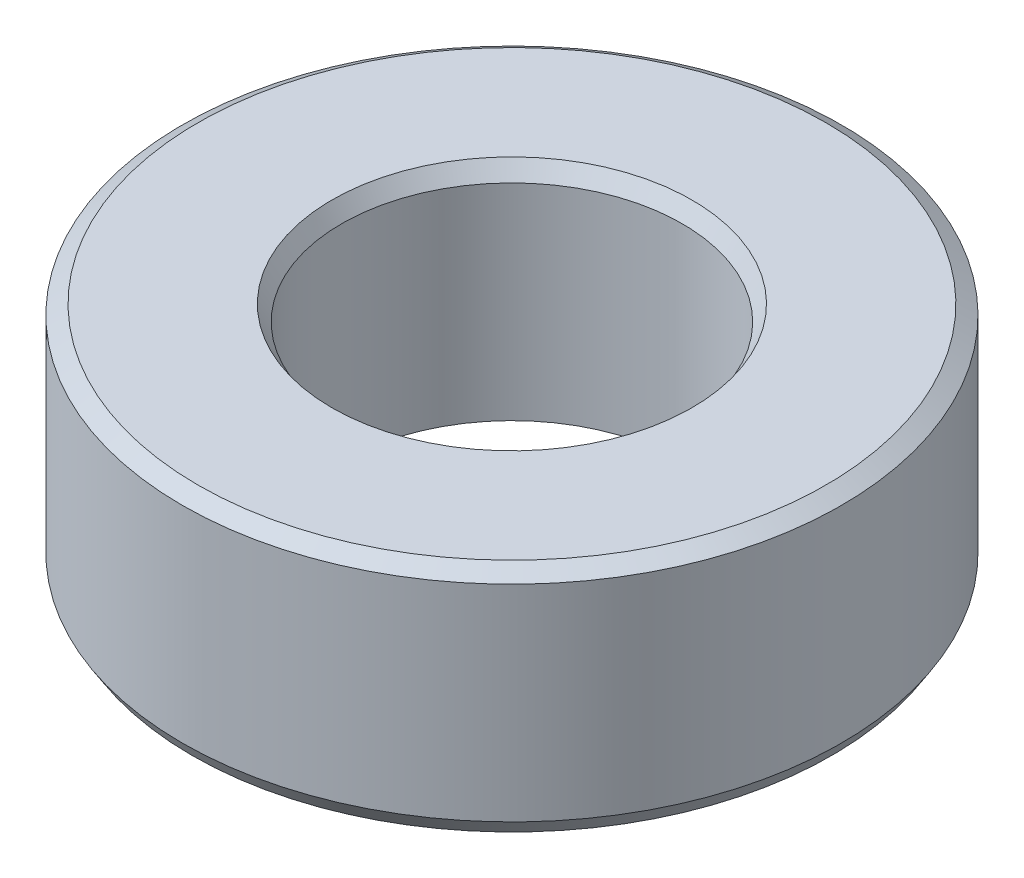
ISO-10303-21;
HEADER;
FILE_DESCRIPTION(('STEP AP214'),'2;1');
FILE_NAME('part.step','',(''),(''),'','','');
FILE_SCHEMA(('AUTOMOTIVE_DESIGN { 1 0 10303 214 1 1 1 1 }'));
ENDSEC;
DATA;
#1=APPLICATION_CONTEXT('core data for automotive mechanical design processes');
#2=APPLICATION_PROTOCOL_DEFINITION('international standard','automotive_design',2000,#1);
#3=PRODUCT_CONTEXT('',#1,'mechanical');
#4=PRODUCT('Part','Part','',(#3));
#5=PRODUCT_RELATED_PRODUCT_CATEGORY('part','',(#4));
#6=PRODUCT_DEFINITION_FORMATION('','',#4);
#7=PRODUCT_DEFINITION_CONTEXT('part definition',#1,'design');
#8=PRODUCT_DEFINITION('design','',#6,#7);
#9=PRODUCT_DEFINITION_SHAPE('','',#8);
#10=(LENGTH_UNIT() NAMED_UNIT(*) SI_UNIT(.MILLI.,.METRE.));
#11=(NAMED_UNIT(*) PLANE_ANGLE_UNIT() SI_UNIT($,.RADIAN.));
#12=(NAMED_UNIT(*) SI_UNIT($,.STERADIAN.) SOLID_ANGLE_UNIT());
#13=UNCERTAINTY_MEASURE_WITH_UNIT(LENGTH_MEASURE(1.E-05),#10,'distance_accuracy_value','');
#14=(GEOMETRIC_REPRESENTATION_CONTEXT(3) GLOBAL_UNCERTAINTY_ASSIGNED_CONTEXT((#13)) GLOBAL_UNIT_ASSIGNED_CONTEXT((#10,
#11,#12)) REPRESENTATION_CONTEXT('',''));
#15=CARTESIAN_POINT('',(0.,0.,0.));
#16=DIRECTION('',(0.,0.,1.));
#17=DIRECTION('',(1.,0.,0.));
#18=AXIS2_PLACEMENT_3D('',#15,#16,#17);
#19=CARTESIAN_POINT('',(0.,35.0864014762134,0.));
#20=DIRECTION('',(0.,-1.,0.));
#21=DIRECTION('',(0.,0.,-1.));
#22=AXIS2_PLACEMENT_3D('',#19,#20,#21);
#23=CYLINDRICAL_SURFACE('',#22,50.);
#24=CARTESIAN_POINT('',(0.,2.37397487798711,0.));
#25=DIRECTION('',(0.,1.,0.));
#26=DIRECTION('',(0.,0.,1.));
#27=AXIS2_PLACEMENT_3D('',#24,#25,#26);
#28=CIRCLE('',#27,50.);
#29=CARTESIAN_POINT('',(0.,2.37397487798711,50.));
#30=VERTEX_POINT('',#29);
#31=EDGE_CURVE('E10',#30,#30,#28,.T.);
#32=ORIENTED_EDGE('',*,*,#31,.T.);
#33=EDGE_LOOP('',(#32));
#34=FACE_BOUND('',#33,.T.);
#35=CARTESIAN_POINT('',(0.,33.6066284404113,0.));
#36=DIRECTION('',(0.,1.,0.));
#37=DIRECTION('',(0.,0.,1.));
#38=AXIS2_PLACEMENT_3D('',#35,#36,#37);
#39=CIRCLE('',#38,50.);
#40=CARTESIAN_POINT('',(0.,33.6066284404113,50.));
#41=VERTEX_POINT('',#40);
#42=EDGE_CURVE('E50',#41,#41,#39,.F.);
#43=ORIENTED_EDGE('',*,*,#42,.T.);
#44=EDGE_LOOP('',(#43));
#45=FACE_BOUND('',#44,.T.);
#46=ADVANCED_FACE('F39',(#34,#45),#23,.T.);
#47=CARTESIAN_POINT('',(0.,35.0864014762134,0.));
#48=DIRECTION('',(0.,1.,0.));
#49=DIRECTION('',(0.,0.,1.));
#50=AXIS2_PLACEMENT_3D('',#47,#48,#49);
#51=PLANE('',#50);
#52=CARTESIAN_POINT('',(0.,35.0864014762134,0.));
#53=DIRECTION('',(0.,1.,0.));
#54=DIRECTION('',(0.,0.,1.));
#55=AXIS2_PLACEMENT_3D('',#52,#53,#54);
#56=CIRCLE('',#55,27.3118431619506);
#57=CARTESIAN_POINT('',(0.,35.0864014762134,27.3118431619506));
#58=VERTEX_POINT('',#57);
#59=EDGE_CURVE('E58',#58,#58,#56,.F.);
#60=ORIENTED_EDGE('',*,*,#59,.T.);
#61=EDGE_LOOP('',(#60));
#62=FACE_BOUND('',#61,.T.);
#63=CARTESIAN_POINT('',(0.,35.0864014762134,0.));
#64=DIRECTION('',(0.,1.,0.));
#65=DIRECTION('',(0.,0.,1.));
#66=AXIS2_PLACEMENT_3D('',#63,#64,#65);
#67=CIRCLE('',#66,47.6260251220129);
#68=CARTESIAN_POINT('',(0.,35.0864014762134,47.6260251220129));
#69=VERTEX_POINT('',#68);
#70=EDGE_CURVE('E61',#69,#69,#67,.T.);
#71=ORIENTED_EDGE('',*,*,#70,.T.);
#72=EDGE_LOOP('',(#71));
#73=FACE_BOUND('',#72,.T.);
#74=ADVANCED_FACE('F88',(#62,#73),#51,.T.);
#75=CARTESIAN_POINT('',(0.,0.,0.));
#76=DIRECTION('',(0.,1.,0.));
#77=DIRECTION('',(0.,0.,1.));
#78=AXIS2_PLACEMENT_3D('',#75,#76,#77);
#79=PLANE('',#78);
#80=CARTESIAN_POINT('',(0.,0.,0.));
#81=DIRECTION('',(0.,1.,0.));
#82=DIRECTION('',(0.,0.,1.));
#83=AXIS2_PLACEMENT_3D('',#80,#81,#82);
#84=CIRCLE('',#83,28.2060450041356);
#85=CARTESIAN_POINT('',(0.,0.,28.2060450041356));
#86=VERTEX_POINT('',#85);
#87=EDGE_CURVE('E51',#86,#86,#84,.T.);
#88=ORIENTED_EDGE('',*,*,#87,.T.);
#89=EDGE_LOOP('',(#88));
#90=FACE_BOUND('',#89,.T.);
#91=CARTESIAN_POINT('',(0.,0.,0.));
#92=DIRECTION('',(0.,1.,0.));
#93=DIRECTION('',(0.,0.,1.));
#94=AXIS2_PLACEMENT_3D('',#91,#92,#93);
#95=CIRCLE('',#94,48.5202269641979);
#96=CARTESIAN_POINT('',(0.,0.,48.5202269641979));
#97=VERTEX_POINT('',#96);
#98=EDGE_CURVE('E54',#97,#97,#95,.F.);
#99=ORIENTED_EDGE('',*,*,#98,.T.);
#100=EDGE_LOOP('',(#99));
#101=FACE_BOUND('',#100,.T.);
#102=ADVANCED_FACE('F83',(#90,#101),#79,.F.);
#103=CARTESIAN_POINT('',(0.,35.0864014762134,0.));
#104=DIRECTION('',(0.,-1.,0.));
#105=DIRECTION('',(0.,0.,-1.));
#106=AXIS2_PLACEMENT_3D('',#103,#104,#105);
#107=CYLINDRICAL_SURFACE('',#106,25.8320701261485);
#108=CARTESIAN_POINT('',(0.,32.7124265982263,0.));
#109=DIRECTION('',(0.,1.,0.));
#110=DIRECTION('',(0.,0.,1.));
#111=AXIS2_PLACEMENT_3D('',#108,#109,#110);
#112=CIRCLE('',#111,25.8320701261485);
#113=CARTESIAN_POINT('',(0.,32.7124265982263,25.8320701261485));
#114=VERTEX_POINT('',#113);
#115=EDGE_CURVE('E67',#114,#114,#112,.T.);
#116=ORIENTED_EDGE('',*,*,#115,.T.);
#117=EDGE_LOOP('',(#116));
#118=FACE_BOUND('',#117,.T.);
#119=CARTESIAN_POINT('',(0.,1.47977303580207,0.));
#120=DIRECTION('',(0.,1.,0.));
#121=DIRECTION('',(0.,0.,1.));
#122=AXIS2_PLACEMENT_3D('',#119,#120,#121);
#123=CIRCLE('',#122,25.8320701261485);
#124=CARTESIAN_POINT('',(0.,1.47977303580207,25.8320701261485));
#125=VERTEX_POINT('',#124);
#126=EDGE_CURVE('E69',#125,#125,#123,.F.);
#127=ORIENTED_EDGE('',*,*,#126,.T.);
#128=EDGE_LOOP('',(#127));
#129=FACE_BOUND('',#128,.T.);
#130=ADVANCED_FACE('F71',(#118,#129),#107,.F.);
#131=CARTESIAN_POINT('',(0.,32.7124265982263,0.));
#132=DIRECTION('',(0.,1.,0.));
#133=DIRECTION('',(0.,0.,1.));
#134=AXIS2_PLACEMENT_3D('',#131,#132,#133);
#135=CONICAL_SURFACE('',#134,25.8320701261485,0.557398508571767);
#136=ORIENTED_EDGE('',*,*,#59,.F.);
#137=EDGE_LOOP('',(#136));
#138=FACE_BOUND('',#137,.T.);
#139=ORIENTED_EDGE('',*,*,#115,.F.);
#140=EDGE_LOOP('',(#139));
#141=FACE_BOUND('',#140,.T.);
#142=ADVANCED_FACE('F77',(#138,#141),#135,.F.);
#143=CARTESIAN_POINT('',(0.,0.,0.));
#144=DIRECTION('',(0.,-1.,0.));
#145=DIRECTION('',(0.,0.,-1.));
#146=AXIS2_PLACEMENT_3D('',#143,#144,#145);
#147=CONICAL_SURFACE('',#146,28.2060450041356,1.01339781822313);
#148=ORIENTED_EDGE('',*,*,#126,.F.);
#149=EDGE_LOOP('',(#148));
#150=FACE_BOUND('',#149,.T.);
#151=ORIENTED_EDGE('',*,*,#87,.F.);
#152=EDGE_LOOP('',(#151));
#153=FACE_BOUND('',#152,.T.);
#154=ADVANCED_FACE('F73',(#150,#153),#147,.F.);
#155=CARTESIAN_POINT('',(0.,2.37397487798711,0.));
#156=DIRECTION('',(0.,1.,0.));
#157=DIRECTION('',(0.,0.,1.));
#158=AXIS2_PLACEMENT_3D('',#155,#156,#157);
#159=CONICAL_SURFACE('',#158,50.,0.557398508571762);
#160=ORIENTED_EDGE('',*,*,#98,.F.);
#161=EDGE_LOOP('',(#160));
#162=FACE_BOUND('',#161,.T.);
#163=ORIENTED_EDGE('',*,*,#31,.F.);
#164=EDGE_LOOP('',(#163));
#165=FACE_BOUND('',#164,.T.);
#166=ADVANCED_FACE('F76',(#162,#165),#159,.T.);
#167=CARTESIAN_POINT('',(0.,35.0864014762134,0.));
#168=DIRECTION('',(0.,-1.,0.));
#169=DIRECTION('',(0.,0.,-1.));
#170=AXIS2_PLACEMENT_3D('',#167,#168,#169);
#171=CONICAL_SURFACE('',#170,47.6260251220129,1.01339781822313);
#172=ORIENTED_EDGE('',*,*,#42,.F.);
#173=EDGE_LOOP('',(#172));
#174=FACE_BOUND('',#173,.T.);
#175=ORIENTED_EDGE('',*,*,#70,.F.);
#176=EDGE_LOOP('',(#175));
#177=FACE_BOUND('',#176,.T.);
#178=ADVANCED_FACE('F45',(#174,#177),#171,.T.);
#179=CLOSED_SHELL('',(#46,#74,#102,#130,#142,#154,#166,#178));
#180=MANIFOLD_SOLID_BREP('B2',#179);
#181=ADVANCED_BREP_SHAPE_REPRESENTATION('',(#18,#180),#14);
#182=SHAPE_DEFINITION_REPRESENTATION(#9,#181);
ENDSEC;
END-ISO-10303-21;
